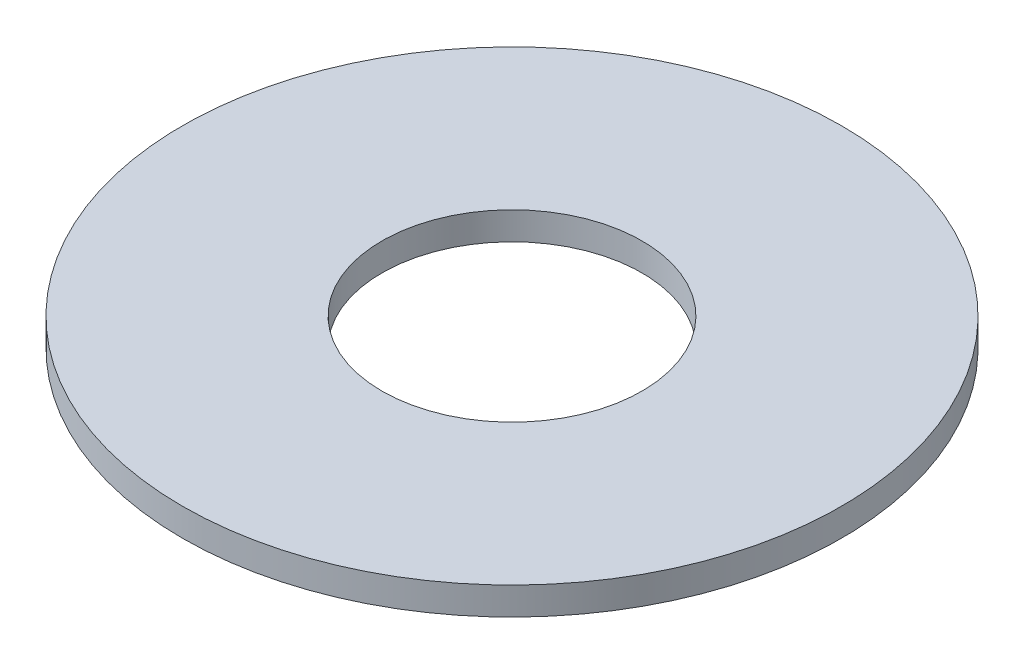
ISO-10303-21;
HEADER;
FILE_DESCRIPTION(('STEP AP214'),'2;1');
FILE_NAME('part.step','',(''),(''),'','','');
FILE_SCHEMA(('AUTOMOTIVE_DESIGN { 1 0 10303 214 1 1 1 1 }'));
ENDSEC;
DATA;
#1=APPLICATION_CONTEXT('core data for automotive mechanical design processes');
#2=APPLICATION_PROTOCOL_DEFINITION('international standard','automotive_design',2000,#1);
#3=PRODUCT_CONTEXT('',#1,'mechanical');
#4=PRODUCT('Part','Part','',(#3));
#5=PRODUCT_RELATED_PRODUCT_CATEGORY('part','',(#4));
#6=PRODUCT_DEFINITION_FORMATION('','',#4);
#7=PRODUCT_DEFINITION_CONTEXT('part definition',#1,'design');
#8=PRODUCT_DEFINITION('design','',#6,#7);
#9=PRODUCT_DEFINITION_SHAPE('','',#8);
#10=(LENGTH_UNIT() NAMED_UNIT(*) SI_UNIT(.MILLI.,.METRE.));
#11=(NAMED_UNIT(*) PLANE_ANGLE_UNIT() SI_UNIT($,.RADIAN.));
#12=(NAMED_UNIT(*) SI_UNIT($,.STERADIAN.) SOLID_ANGLE_UNIT());
#13=UNCERTAINTY_MEASURE_WITH_UNIT(LENGTH_MEASURE(1.E-05),#10,'distance_accuracy_value','');
#14=(GEOMETRIC_REPRESENTATION_CONTEXT(3) GLOBAL_UNCERTAINTY_ASSIGNED_CONTEXT((#13)) GLOBAL_UNIT_ASSIGNED_CONTEXT((#10,
#11,#12)) REPRESENTATION_CONTEXT('',''));
#15=CARTESIAN_POINT('',(0.,0.,0.));
#16=DIRECTION('',(0.,0.,1.));
#17=DIRECTION('',(1.,0.,0.));
#18=AXIS2_PLACEMENT_3D('',#15,#16,#17);
#19=CARTESIAN_POINT('',(0.,8.,0.));
#20=DIRECTION('',(0.,-1.,0.));
#21=DIRECTION('',(0.,0.,-1.));
#22=AXIS2_PLACEMENT_3D('',#19,#20,#21);
#23=CYLINDRICAL_SURFACE('',#22,95.);
#24=CARTESIAN_POINT('',(0.,8.,0.));
#25=DIRECTION('',(0.,1.,0.));
#26=DIRECTION('',(0.,0.,1.));
#27=AXIS2_PLACEMENT_3D('',#24,#25,#26);
#28=CIRCLE('',#27,95.);
#29=CARTESIAN_POINT('',(0.,8.,95.));
#30=VERTEX_POINT('',#29);
#31=EDGE_CURVE('E10',#30,#30,#28,.T.);
#32=ORIENTED_EDGE('',*,*,#31,.F.);
#33=EDGE_LOOP('',(#32));
#34=FACE_BOUND('',#33,.T.);
#35=CARTESIAN_POINT('',(0.,0.,0.));
#36=DIRECTION('',(0.,1.,0.));
#37=DIRECTION('',(0.,0.,1.));
#38=AXIS2_PLACEMENT_3D('',#35,#36,#37);
#39=CIRCLE('',#38,95.);
#40=CARTESIAN_POINT('',(0.,0.,95.));
#41=VERTEX_POINT('',#40);
#42=EDGE_CURVE('E37',#41,#41,#39,.T.);
#43=ORIENTED_EDGE('',*,*,#42,.T.);
#44=EDGE_LOOP('',(#43));
#45=FACE_BOUND('',#44,.T.);
#46=ADVANCED_FACE('F40',(#34,#45),#23,.T.);
#47=CARTESIAN_POINT('',(0.,8.,0.));
#48=DIRECTION('',(0.,1.,0.));
#49=DIRECTION('',(0.,0.,1.));
#50=AXIS2_PLACEMENT_3D('',#47,#48,#49);
#51=PLANE('',#50);
#52=CARTESIAN_POINT('',(0.,8.,0.));
#53=DIRECTION('',(0.,1.,0.));
#54=DIRECTION('',(0.,0.,1.));
#55=AXIS2_PLACEMENT_3D('',#52,#53,#54);
#56=CIRCLE('',#55,37.5);
#57=CARTESIAN_POINT('',(0.,8.,37.5));
#58=VERTEX_POINT('',#57);
#59=EDGE_CURVE('E50',#58,#58,#56,.T.);
#60=ORIENTED_EDGE('',*,*,#59,.F.);
#61=EDGE_LOOP('',(#60));
#62=FACE_BOUND('',#61,.T.);
#63=ORIENTED_EDGE('',*,*,#31,.T.);
#64=EDGE_LOOP('',(#63));
#65=FACE_BOUND('',#64,.T.);
#66=ADVANCED_FACE('F59',(#62,#65),#51,.T.);
#67=CARTESIAN_POINT('',(0.,0.,0.));
#68=DIRECTION('',(0.,1.,0.));
#69=DIRECTION('',(0.,0.,1.));
#70=AXIS2_PLACEMENT_3D('',#67,#68,#69);
#71=PLANE('',#70);
#72=CARTESIAN_POINT('',(0.,0.,0.));
#73=DIRECTION('',(0.,1.,0.));
#74=DIRECTION('',(0.,0.,1.));
#75=AXIS2_PLACEMENT_3D('',#72,#73,#74);
#76=CIRCLE('',#75,37.5);
#77=CARTESIAN_POINT('',(0.,0.,37.5));
#78=VERTEX_POINT('',#77);
#79=EDGE_CURVE('E47',#78,#78,#76,.T.);
#80=ORIENTED_EDGE('',*,*,#79,.T.);
#81=EDGE_LOOP('',(#80));
#82=FACE_BOUND('',#81,.T.);
#83=ORIENTED_EDGE('',*,*,#42,.F.);
#84=EDGE_LOOP('',(#83));
#85=FACE_BOUND('',#84,.T.);
#86=ADVANCED_FACE('F58',(#82,#85),#71,.F.);
#87=CARTESIAN_POINT('',(0.,8.,0.));
#88=DIRECTION('',(0.,-1.,0.));
#89=DIRECTION('',(0.,0.,-1.));
#90=AXIS2_PLACEMENT_3D('',#87,#88,#89);
#91=CYLINDRICAL_SURFACE('',#90,37.5);
#92=ORIENTED_EDGE('',*,*,#59,.T.);
#93=EDGE_LOOP('',(#92));
#94=FACE_BOUND('',#93,.T.);
#95=ORIENTED_EDGE('',*,*,#79,.F.);
#96=EDGE_LOOP('',(#95));
#97=FACE_BOUND('',#96,.T.);
#98=ADVANCED_FACE('F54',(#94,#97),#91,.F.);
#99=CLOSED_SHELL('',(#46,#66,#86,#98));
#100=MANIFOLD_SOLID_BREP('B2',#99);
#101=ADVANCED_BREP_SHAPE_REPRESENTATION('',(#18,#100),#14);
#102=SHAPE_DEFINITION_REPRESENTATION(#9,#101);
ENDSEC;
END-ISO-10303-21;
